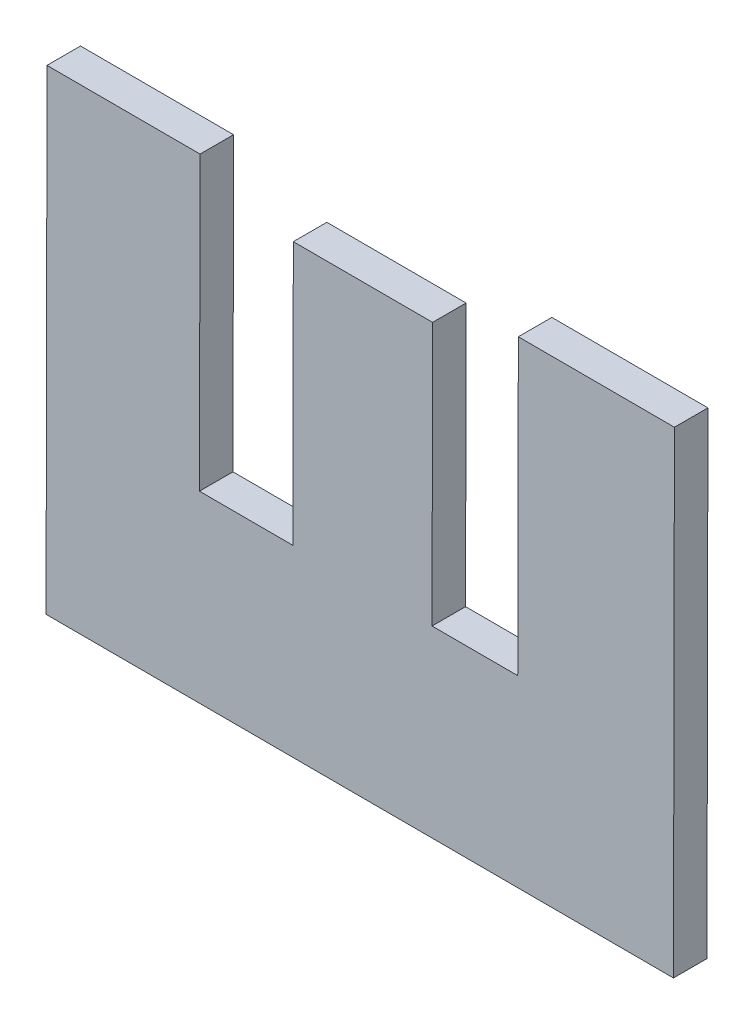
ISO-10303-21;
HEADER;
FILE_DESCRIPTION(('STEP AP214'),'2;1');
FILE_NAME('part.step','',(''),(''),'','','');
FILE_SCHEMA(('AUTOMOTIVE_DESIGN { 1 0 10303 214 1 1 1 1 }'));
ENDSEC;
DATA;
#1=APPLICATION_CONTEXT('core data for automotive mechanical design processes');
#2=APPLICATION_PROTOCOL_DEFINITION('international standard','automotive_design',2000,#1);
#3=PRODUCT_CONTEXT('',#1,'mechanical');
#4=PRODUCT('Part','Part','',(#3));
#5=PRODUCT_RELATED_PRODUCT_CATEGORY('part','',(#4));
#6=PRODUCT_DEFINITION_FORMATION('','',#4);
#7=PRODUCT_DEFINITION_CONTEXT('part definition',#1,'design');
#8=PRODUCT_DEFINITION('design','',#6,#7);
#9=PRODUCT_DEFINITION_SHAPE('','',#8);
#10=(LENGTH_UNIT() NAMED_UNIT(*) SI_UNIT(.MILLI.,.METRE.));
#11=(NAMED_UNIT(*) PLANE_ANGLE_UNIT() SI_UNIT($,.RADIAN.));
#12=(NAMED_UNIT(*) SI_UNIT($,.STERADIAN.) SOLID_ANGLE_UNIT());
#13=UNCERTAINTY_MEASURE_WITH_UNIT(LENGTH_MEASURE(1.E-05),#10,'distance_accuracy_value','');
#14=(GEOMETRIC_REPRESENTATION_CONTEXT(3) GLOBAL_UNCERTAINTY_ASSIGNED_CONTEXT((#13)) GLOBAL_UNIT_ASSIGNED_CONTEXT((#10,
#11,#12)) REPRESENTATION_CONTEXT('',''));
#15=CARTESIAN_POINT('',(0.,0.,0.));
#16=DIRECTION('',(0.,0.,1.));
#17=DIRECTION('',(1.,0.,0.));
#18=AXIS2_PLACEMENT_3D('',#15,#16,#17);
#19=CARTESIAN_POINT('',(-0.232832296777795,0.227581846757075,-0.37));
#20=DIRECTION('',(0.0019749154552477,0.999998049852571,0.));
#21=DIRECTION('',(0.999998049852571,-0.0019749154552477,0.));
#22=AXIS2_PLACEMENT_3D('',#19,#20,#21);
#23=PLANE('',#22);
#24=DIRECTION('',(0.999998049852571,-0.0019749154552477,0.));
#25=VECTOR('',#24,1.);
#26=CARTESIAN_POINT('',(-0.232832296777795,0.227581846757075,-0.37));
#27=LINE('',#26,#25);
#28=CARTESIAN_POINT('',(-0.232832296777795,0.227581846757075,-0.37));
#29=VERTEX_POINT('',#28);
#30=CARTESIAN_POINT('',(-0.219134809045468,0.227554795324101,-0.37));
#31=VERTEX_POINT('',#30);
#32=EDGE_CURVE('E11',#29,#31,#27,.T.);
#33=ORIENTED_EDGE('',*,*,#32,.T.);
#34=DIRECTION('',(0.,0.,-1.));
#35=VECTOR('',#34,1.);
#36=CARTESIAN_POINT('',(-0.219134809045468,0.227554795324101,-0.37));
#37=LINE('',#36,#35);
#38=CARTESIAN_POINT('',(-0.219134809045468,0.227554795324101,-0.373));
#39=VERTEX_POINT('',#38);
#40=EDGE_CURVE('E24',#31,#39,#37,.T.);
#41=ORIENTED_EDGE('',*,*,#40,.T.);
#42=DIRECTION('',(0.999998049852571,-0.0019749154552477,0.));
#43=VECTOR('',#42,1.);
#44=CARTESIAN_POINT('',(-0.232832296777795,0.227581846757075,-0.373));
#45=LINE('',#44,#43);
#46=CARTESIAN_POINT('',(-0.232832296777795,0.227581846757075,-0.373));
#47=VERTEX_POINT('',#46);
#48=EDGE_CURVE('E124',#47,#39,#45,.T.);
#49=ORIENTED_EDGE('',*,*,#48,.F.);
#50=DIRECTION('',(0.,0.,-1.));
#51=VECTOR('',#50,1.);
#52=CARTESIAN_POINT('',(-0.232832296777795,0.227581846757075,-0.37));
#53=LINE('',#52,#51);
#54=EDGE_CURVE('E206',#29,#47,#53,.T.);
#55=ORIENTED_EDGE('',*,*,#54,.F.);
#56=EDGE_LOOP('',(#33,#41,#49,#55));
#57=FACE_BOUND('',#56,.T.);
#58=ADVANCED_FACE('F17',(#57),#23,.T.);
#59=CARTESIAN_POINT('',(-0.23291642568743,0.184983190016065,-0.37));
#60=DIRECTION('',(-0.999998049852571,0.0019749154552669,0.));
#61=DIRECTION('',(0.0019749154552669,0.999998049852571,0.));
#62=AXIS2_PLACEMENT_3D('',#59,#60,#61);
#63=PLANE('',#62);
#64=DIRECTION('',(0.0019749154552669,0.999998049852571,0.));
#65=VECTOR('',#64,1.);
#66=CARTESIAN_POINT('',(-0.23291642568743,0.184983190016065,-0.37));
#67=LINE('',#66,#65);
#68=CARTESIAN_POINT('',(-0.23291642568743,0.184983190016065,-0.37));
#69=VERTEX_POINT('',#68);
#70=EDGE_CURVE('E203',#69,#29,#67,.T.);
#71=ORIENTED_EDGE('',*,*,#70,.T.);
#72=ORIENTED_EDGE('',*,*,#54,.T.);
#73=DIRECTION('',(0.0019749154552669,0.999998049852571,0.));
#74=VECTOR('',#73,1.);
#75=CARTESIAN_POINT('',(-0.23291642568743,0.184983190016065,-0.373));
#76=LINE('',#75,#74);
#77=CARTESIAN_POINT('',(-0.23291642568743,0.184983190016065,-0.373));
#78=VERTEX_POINT('',#77);
#79=EDGE_CURVE('E201',#78,#47,#76,.T.);
#80=ORIENTED_EDGE('',*,*,#79,.F.);
#81=DIRECTION('',(0.,0.,-1.));
#82=VECTOR('',#81,1.);
#83=CARTESIAN_POINT('',(-0.23291642568743,0.184983190016065,-0.37));
#84=LINE('',#83,#82);
#85=EDGE_CURVE('E198',#69,#78,#84,.T.);
#86=ORIENTED_EDGE('',*,*,#85,.F.);
#87=EDGE_LOOP('',(#71,#72,#80,#86));
#88=FACE_BOUND('',#87,.T.);
#89=ADVANCED_FACE('F235',(#88),#63,.T.);
#90=CARTESIAN_POINT('',(-0.176757993630782,0.184872281644366,-0.37));
#91=DIRECTION('',(-0.0019749154552616,-0.999998049852571,0.));
#92=DIRECTION('',(-0.999998049852571,0.0019749154552616,0.));
#93=AXIS2_PLACEMENT_3D('',#90,#91,#92);
#94=PLANE('',#93);
#95=DIRECTION('',(-0.999998049852571,0.0019749154552616,0.));
#96=VECTOR('',#95,1.);
#97=CARTESIAN_POINT('',(-0.176757993630782,0.184872281644366,-0.37));
#98=LINE('',#97,#96);
#99=CARTESIAN_POINT('',(-0.176757993630782,0.184872281644366,-0.37));
#100=VERTEX_POINT('',#99);
#101=EDGE_CURVE('E195',#100,#69,#98,.T.);
#102=ORIENTED_EDGE('',*,*,#101,.T.);
#103=ORIENTED_EDGE('',*,*,#85,.T.);
#104=DIRECTION('',(-0.999998049852571,0.0019749154552616,0.));
#105=VECTOR('',#104,1.);
#106=CARTESIAN_POINT('',(-0.176757993630782,0.184872281644366,-0.373));
#107=LINE('',#106,#105);
#108=CARTESIAN_POINT('',(-0.176757993630782,0.184872281644366,-0.373));
#109=VERTEX_POINT('',#108);
#110=EDGE_CURVE('E192',#109,#78,#107,.T.);
#111=ORIENTED_EDGE('',*,*,#110,.F.);
#112=DIRECTION('',(0.,0.,-1.));
#113=VECTOR('',#112,1.);
#114=CARTESIAN_POINT('',(-0.176757993630782,0.184872281644366,-0.37));
#115=LINE('',#114,#113);
#116=EDGE_CURVE('E189',#100,#109,#115,.T.);
#117=ORIENTED_EDGE('',*,*,#116,.F.);
#118=EDGE_LOOP('',(#102,#103,#111,#117));
#119=FACE_BOUND('',#118,.T.);
#120=ADVANCED_FACE('F232',(#119),#94,.T.);
#121=CARTESIAN_POINT('',(-0.176673591612283,0.227609227004608,-0.37));
#122=DIRECTION('',(0.999998049852571,-0.0019749154552604,0.));
#123=DIRECTION('',(-0.0019749154552604,-0.999998049852571,0.));
#124=AXIS2_PLACEMENT_3D('',#121,#122,#123);
#125=PLANE('',#124);
#126=DIRECTION('',(-0.0019749154552604,-0.999998049852571,0.));
#127=VECTOR('',#126,1.);
#128=CARTESIAN_POINT('',(-0.176673591612283,0.227609227004608,-0.37));
#129=LINE('',#128,#127);
#130=CARTESIAN_POINT('',(-0.176673591612283,0.227609227004608,-0.37));
#131=VERTEX_POINT('',#130);
#132=EDGE_CURVE('E186',#131,#100,#129,.T.);
#133=ORIENTED_EDGE('',*,*,#132,.T.);
#134=ORIENTED_EDGE('',*,*,#116,.T.);
#135=DIRECTION('',(-0.0019749154552604,-0.999998049852571,0.));
#136=VECTOR('',#135,1.);
#137=CARTESIAN_POINT('',(-0.176673591612283,0.227609227004608,-0.373));
#138=LINE('',#137,#136);
#139=CARTESIAN_POINT('',(-0.176673591612283,0.227609227004608,-0.373));
#140=VERTEX_POINT('',#139);
#141=EDGE_CURVE('E183',#140,#109,#138,.T.);
#142=ORIENTED_EDGE('',*,*,#141,.F.);
#143=DIRECTION('',(0.,0.,-1.));
#144=VECTOR('',#143,1.);
#145=CARTESIAN_POINT('',(-0.176673591612283,0.227609227004608,-0.37));
#146=LINE('',#145,#144);
#147=EDGE_CURVE('E180',#131,#140,#146,.T.);
#148=ORIENTED_EDGE('',*,*,#147,.F.);
#149=EDGE_LOOP('',(#133,#134,#142,#148));
#150=FACE_BOUND('',#149,.T.);
#151=ADVANCED_FACE('F229',(#150),#125,.T.);
#152=CARTESIAN_POINT('',(-0.190644775570028,0.227636818965544,-0.37));
#153=DIRECTION('',(0.0019749154552852,0.999998049852571,0.));
#154=DIRECTION('',(0.999998049852571,-0.0019749154552852,0.));
#155=AXIS2_PLACEMENT_3D('',#152,#153,#154);
#156=PLANE('',#155);
#157=DIRECTION('',(0.999998049852571,-0.0019749154552852,0.));
#158=VECTOR('',#157,1.);
#159=CARTESIAN_POINT('',(-0.190644775570028,0.227636818965544,-0.37));
#160=LINE('',#159,#158);
#161=CARTESIAN_POINT('',(-0.190644775570028,0.227636818965544,-0.37));
#162=VERTEX_POINT('',#161);
#163=EDGE_CURVE('E177',#162,#131,#160,.T.);
#164=ORIENTED_EDGE('',*,*,#163,.T.);
#165=ORIENTED_EDGE('',*,*,#147,.T.);
#166=DIRECTION('',(0.999998049852571,-0.0019749154552852,0.));
#167=VECTOR('',#166,1.);
#168=CARTESIAN_POINT('',(-0.190644775570028,0.227636818965544,-0.373));
#169=LINE('',#168,#167);
#170=CARTESIAN_POINT('',(-0.190644775570028,0.227636818965544,-0.373));
#171=VERTEX_POINT('',#170);
#172=EDGE_CURVE('E174',#171,#140,#169,.T.);
#173=ORIENTED_EDGE('',*,*,#172,.F.);
#174=DIRECTION('',(0.,0.,-1.));
#175=VECTOR('',#174,1.);
#176=CARTESIAN_POINT('',(-0.190644775570028,0.227636818965544,-0.37));
#177=LINE('',#176,#175);
#178=EDGE_CURVE('E171',#162,#171,#177,.T.);
#179=ORIENTED_EDGE('',*,*,#178,.F.);
#180=EDGE_LOOP('',(#164,#165,#173,#179));
#181=FACE_BOUND('',#180,.T.);
#182=ADVANCED_FACE('F226',(#181),#156,.T.);
#183=CARTESIAN_POINT('',(-0.190696711772324,0.201338933213314,-0.37));
#184=DIRECTION('',(-0.999998049852571,0.0019749154552656,0.));
#185=DIRECTION('',(0.0019749154552656,0.999998049852571,0.));
#186=AXIS2_PLACEMENT_3D('',#183,#184,#185);
#187=PLANE('',#186);
#188=DIRECTION('',(0.0019749154552656,0.999998049852571,0.));
#189=VECTOR('',#188,1.);
#190=CARTESIAN_POINT('',(-0.190696711772324,0.201338933213314,-0.37));
#191=LINE('',#190,#189);
#192=CARTESIAN_POINT('',(-0.190696711772324,0.201338933213314,-0.37));
#193=VERTEX_POINT('',#192);
#194=EDGE_CURVE('E168',#193,#162,#191,.T.);
#195=ORIENTED_EDGE('',*,*,#194,.T.);
#196=ORIENTED_EDGE('',*,*,#178,.T.);
#197=DIRECTION('',(0.0019749154552656,0.999998049852571,0.));
#198=VECTOR('',#197,1.);
#199=CARTESIAN_POINT('',(-0.190696711772324,0.201338933213314,-0.373));
#200=LINE('',#199,#198);
#201=CARTESIAN_POINT('',(-0.190696711772324,0.201338933213314,-0.373));
#202=VERTEX_POINT('',#201);
#203=EDGE_CURVE('E165',#202,#171,#200,.T.);
#204=ORIENTED_EDGE('',*,*,#203,.F.);
#205=DIRECTION('',(0.,0.,-1.));
#206=VECTOR('',#205,1.);
#207=CARTESIAN_POINT('',(-0.190696711772324,0.201338933213314,-0.37));
#208=LINE('',#207,#206);
#209=EDGE_CURVE('E162',#193,#202,#208,.T.);
#210=ORIENTED_EDGE('',*,*,#209,.F.);
#211=EDGE_LOOP('',(#195,#196,#204,#210));
#212=FACE_BOUND('',#211,.T.);
#213=ADVANCED_FACE('F223',(#212),#187,.T.);
#214=CARTESIAN_POINT('',(-0.198367120517592,0.201354081651635,-0.37));
#215=DIRECTION('',(0.0019749154552558,0.999998049852571,0.));
#216=DIRECTION('',(0.999998049852571,-0.0019749154552558,0.));
#217=AXIS2_PLACEMENT_3D('',#214,#215,#216);
#218=PLANE('',#217);
#219=DIRECTION('',(0.999998049852571,-0.0019749154552558,0.));
#220=VECTOR('',#219,1.);
#221=CARTESIAN_POINT('',(-0.198367120517592,0.201354081651635,-0.37));
#222=LINE('',#221,#220);
#223=CARTESIAN_POINT('',(-0.198367120517592,0.201354081651635,-0.37));
#224=VERTEX_POINT('',#223);
#225=EDGE_CURVE('E159',#224,#193,#222,.T.);
#226=ORIENTED_EDGE('',*,*,#225,.T.);
#227=ORIENTED_EDGE('',*,*,#209,.T.);
#228=DIRECTION('',(0.999998049852571,-0.0019749154552558,0.));
#229=VECTOR('',#228,1.);
#230=CARTESIAN_POINT('',(-0.198367120517592,0.201354081651635,-0.373));
#231=LINE('',#230,#229);
#232=CARTESIAN_POINT('',(-0.198367120517592,0.201354081651635,-0.373));
#233=VERTEX_POINT('',#232);
#234=EDGE_CURVE('E156',#233,#202,#231,.T.);
#235=ORIENTED_EDGE('',*,*,#234,.F.);
#236=DIRECTION('',(0.,0.,-1.));
#237=VECTOR('',#236,1.);
#238=CARTESIAN_POINT('',(-0.198367120517592,0.201354081651635,-0.37));
#239=LINE('',#238,#237);
#240=EDGE_CURVE('E153',#224,#233,#239,.T.);
#241=ORIENTED_EDGE('',*,*,#240,.F.);
#242=EDGE_LOOP('',(#226,#227,#235,#241));
#243=FACE_BOUND('',#242,.T.);
#244=ADVANCED_FACE('F220',(#243),#218,.T.);
#245=CARTESIAN_POINT('',(-0.198320589594896,0.224915005148771,-0.37));
#246=DIRECTION('',(0.999998049852571,-0.0019749154552604,0.));
#247=DIRECTION('',(-0.0019749154552604,-0.999998049852571,0.));
#248=AXIS2_PLACEMENT_3D('',#245,#246,#247);
#249=PLANE('',#248);
#250=DIRECTION('',(-0.0019749154552604,-0.999998049852571,0.));
#251=VECTOR('',#250,1.);
#252=CARTESIAN_POINT('',(-0.198320589594896,0.224915005148771,-0.37));
#253=LINE('',#252,#251);
#254=CARTESIAN_POINT('',(-0.198320589594896,0.224915005148771,-0.37));
#255=VERTEX_POINT('',#254);
#256=EDGE_CURVE('E150',#255,#224,#253,.T.);
#257=ORIENTED_EDGE('',*,*,#256,.T.);
#258=ORIENTED_EDGE('',*,*,#240,.T.);
#259=DIRECTION('',(-0.0019749154552604,-0.999998049852571,0.));
#260=VECTOR('',#259,1.);
#261=CARTESIAN_POINT('',(-0.198320589594896,0.224915005148771,-0.373));
#262=LINE('',#261,#260);
#263=CARTESIAN_POINT('',(-0.198320589594896,0.224915005148771,-0.373));
#264=VERTEX_POINT('',#263);
#265=EDGE_CURVE('E147',#264,#233,#262,.T.);
#266=ORIENTED_EDGE('',*,*,#265,.F.);
#267=DIRECTION('',(0.,0.,-1.));
#268=VECTOR('',#267,1.);
#269=CARTESIAN_POINT('',(-0.198320589594896,0.224915005148771,-0.37));
#270=LINE('',#269,#268);
#271=EDGE_CURVE('E144',#255,#264,#270,.T.);
#272=ORIENTED_EDGE('',*,*,#271,.F.);
#273=EDGE_LOOP('',(#257,#258,#266,#272));
#274=FACE_BOUND('',#273,.T.);
#275=ADVANCED_FACE('F217',(#274),#249,.T.);
#276=CARTESIAN_POINT('',(-0.210785003805928,0.224939621361043,-0.37));
#277=DIRECTION('',(0.0019749154552715,0.999998049852571,0.));
#278=DIRECTION('',(0.999998049852571,-0.0019749154552715,0.));
#279=AXIS2_PLACEMENT_3D('',#276,#277,#278);
#280=PLANE('',#279);
#281=DIRECTION('',(0.999998049852571,-0.0019749154552715,0.));
#282=VECTOR('',#281,1.);
#283=CARTESIAN_POINT('',(-0.210785003805928,0.224939621361043,-0.37));
#284=LINE('',#283,#282);
#285=CARTESIAN_POINT('',(-0.210785003805928,0.224939621361043,-0.37));
#286=VERTEX_POINT('',#285);
#287=EDGE_CURVE('E141',#286,#255,#284,.T.);
#288=ORIENTED_EDGE('',*,*,#287,.T.);
#289=ORIENTED_EDGE('',*,*,#271,.T.);
#290=DIRECTION('',(0.999998049852571,-0.0019749154552715,0.));
#291=VECTOR('',#290,1.);
#292=CARTESIAN_POINT('',(-0.210785003805928,0.224939621361043,-0.373));
#293=LINE('',#292,#291);
#294=CARTESIAN_POINT('',(-0.210785003805928,0.224939621361043,-0.373));
#295=VERTEX_POINT('',#294);
#296=EDGE_CURVE('E138',#295,#264,#293,.T.);
#297=ORIENTED_EDGE('',*,*,#296,.F.);
#298=DIRECTION('',(0.,0.,-1.));
#299=VECTOR('',#298,1.);
#300=CARTESIAN_POINT('',(-0.210785003805928,0.224939621361043,-0.37));
#301=LINE('',#300,#299);
#302=EDGE_CURVE('E135',#286,#295,#301,.T.);
#303=ORIENTED_EDGE('',*,*,#302,.F.);
#304=EDGE_LOOP('',(#288,#289,#297,#303));
#305=FACE_BOUND('',#304,.T.);
#306=ADVANCED_FACE('F214',(#305),#280,.T.);
#307=CARTESIAN_POINT('',(-0.210831534728625,0.201378697863906,-0.37));
#308=DIRECTION('',(-0.999998049852571,0.0019749154552604,0.));
#309=DIRECTION('',(0.0019749154552604,0.999998049852571,0.));
#310=AXIS2_PLACEMENT_3D('',#307,#308,#309);
#311=PLANE('',#310);
#312=DIRECTION('',(0.0019749154552604,0.999998049852571,0.));
#313=VECTOR('',#312,1.);
#314=CARTESIAN_POINT('',(-0.210831534728625,0.201378697863906,-0.37));
#315=LINE('',#314,#313);
#316=CARTESIAN_POINT('',(-0.210831534728625,0.201378697863906,-0.37));
#317=VERTEX_POINT('',#316);
#318=EDGE_CURVE('E132',#317,#286,#315,.T.);
#319=ORIENTED_EDGE('',*,*,#318,.T.);
#320=ORIENTED_EDGE('',*,*,#302,.T.);
#321=DIRECTION('',(0.0019749154552604,0.999998049852571,0.));
#322=VECTOR('',#321,1.);
#323=CARTESIAN_POINT('',(-0.210831534728625,0.201378697863906,-0.373));
#324=LINE('',#323,#322);
#325=CARTESIAN_POINT('',(-0.210831534728625,0.201378697863906,-0.373));
#326=VERTEX_POINT('',#325);
#327=EDGE_CURVE('E130',#326,#295,#324,.T.);
#328=ORIENTED_EDGE('',*,*,#327,.F.);
#329=DIRECTION('',(0.,0.,-1.));
#330=VECTOR('',#329,1.);
#331=CARTESIAN_POINT('',(-0.210831534728625,0.201378697863906,-0.37));
#332=LINE('',#331,#330);
#333=EDGE_CURVE('E109',#317,#326,#332,.T.);
#334=ORIENTED_EDGE('',*,*,#333,.F.);
#335=EDGE_LOOP('',(#319,#320,#328,#334));
#336=FACE_BOUND('',#335,.T.);
#337=ADVANCED_FACE('F212',(#336),#311,.T.);
#338=CARTESIAN_POINT('',(-0.219186472138899,0.201395198191104,-0.37));
#339=DIRECTION('',(0.001974915455277,0.999998049852571,0.));
#340=DIRECTION('',(0.999998049852571,-0.001974915455277,0.));
#341=AXIS2_PLACEMENT_3D('',#338,#339,#340);
#342=PLANE('',#341);
#343=DIRECTION('',(0.999998049852571,-0.001974915455277,0.));
#344=VECTOR('',#343,1.);
#345=CARTESIAN_POINT('',(-0.219186472138899,0.201395198191104,-0.37));
#346=LINE('',#345,#344);
#347=CARTESIAN_POINT('',(-0.219186472138899,0.201395198191104,-0.37));
#348=VERTEX_POINT('',#347);
#349=EDGE_CURVE('E113',#348,#317,#346,.T.);
#350=ORIENTED_EDGE('',*,*,#349,.T.);
#351=ORIENTED_EDGE('',*,*,#333,.T.);
#352=DIRECTION('',(0.999998049852571,-0.001974915455277,0.));
#353=VECTOR('',#352,1.);
#354=CARTESIAN_POINT('',(-0.219186472138899,0.201395198191104,-0.373));
#355=LINE('',#354,#353);
#356=CARTESIAN_POINT('',(-0.219186472138899,0.201395198191104,-0.373));
#357=VERTEX_POINT('',#356);
#358=EDGE_CURVE('E102',#357,#326,#355,.T.);
#359=ORIENTED_EDGE('',*,*,#358,.F.);
#360=DIRECTION('',(0.,0.,-1.));
#361=VECTOR('',#360,1.);
#362=CARTESIAN_POINT('',(-0.219186472138899,0.201395198191104,-0.37));
#363=LINE('',#362,#361);
#364=EDGE_CURVE('E106',#348,#357,#363,.T.);
#365=ORIENTED_EDGE('',*,*,#364,.F.);
#366=EDGE_LOOP('',(#350,#351,#359,#365));
#367=FACE_BOUND('',#366,.T.);
#368=ADVANCED_FACE('F105',(#367),#342,.T.);
#369=CARTESIAN_POINT('',(-0.219134809045468,0.227554795324101,-0.37));
#370=DIRECTION('',(0.999998049852571,-0.0019749154552604,0.));
#371=DIRECTION('',(-0.0019749154552604,-0.999998049852571,0.));
#372=AXIS2_PLACEMENT_3D('',#369,#370,#371);
#373=PLANE('',#372);
#374=DIRECTION('',(-0.0019749154552604,-0.999998049852571,0.));
#375=VECTOR('',#374,1.);
#376=CARTESIAN_POINT('',(-0.219134809045468,0.227554795324101,-0.37));
#377=LINE('',#376,#375);
#378=EDGE_CURVE('E119',#31,#348,#377,.T.);
#379=ORIENTED_EDGE('',*,*,#378,.T.);
#380=ORIENTED_EDGE('',*,*,#364,.T.);
#381=DIRECTION('',(-0.0019749154552604,-0.999998049852571,0.));
#382=VECTOR('',#381,1.);
#383=CARTESIAN_POINT('',(-0.219134809045468,0.227554795324101,-0.373));
#384=LINE('',#383,#382);
#385=EDGE_CURVE('E118',#39,#357,#384,.T.);
#386=ORIENTED_EDGE('',*,*,#385,.F.);
#387=ORIENTED_EDGE('',*,*,#40,.F.);
#388=EDGE_LOOP('',(#379,#380,#386,#387));
#389=FACE_BOUND('',#388,.T.);
#390=ADVANCED_FACE('F117',(#389),#373,.T.);
#391=CARTESIAN_POINT('',(-0.204795008649857,0.206254550304955,-0.373));
#392=DIRECTION('',(0.,0.,-1.));
#393=DIRECTION('',(-1.,0.,0.));
#394=AXIS2_PLACEMENT_3D('',#391,#392,#393);
#395=PLANE('',#394);
#396=ORIENTED_EDGE('',*,*,#385,.T.);
#397=ORIENTED_EDGE('',*,*,#358,.T.);
#398=ORIENTED_EDGE('',*,*,#327,.T.);
#399=ORIENTED_EDGE('',*,*,#296,.T.);
#400=ORIENTED_EDGE('',*,*,#265,.T.);
#401=ORIENTED_EDGE('',*,*,#234,.T.);
#402=ORIENTED_EDGE('',*,*,#203,.T.);
#403=ORIENTED_EDGE('',*,*,#172,.T.);
#404=ORIENTED_EDGE('',*,*,#141,.T.);
#405=ORIENTED_EDGE('',*,*,#110,.T.);
#406=ORIENTED_EDGE('',*,*,#79,.T.);
#407=ORIENTED_EDGE('',*,*,#48,.T.);
#408=EDGE_LOOP('',(#396,#397,#398,#399,#400,#401,#402,#403,#404,#405,#406,#407));
#409=FACE_BOUND('',#408,.T.);
#410=ADVANCED_FACE('F122',(#409),#395,.T.);
#411=CARTESIAN_POINT('',(-0.204795008649857,0.206254550304955,-0.37));
#412=DIRECTION('',(0.,0.,-1.));
#413=DIRECTION('',(-1.,0.,0.));
#414=AXIS2_PLACEMENT_3D('',#411,#412,#413);
#415=PLANE('',#414);
#416=ORIENTED_EDGE('',*,*,#378,.F.);
#417=ORIENTED_EDGE('',*,*,#32,.F.);
#418=ORIENTED_EDGE('',*,*,#70,.F.);
#419=ORIENTED_EDGE('',*,*,#101,.F.);
#420=ORIENTED_EDGE('',*,*,#132,.F.);
#421=ORIENTED_EDGE('',*,*,#163,.F.);
#422=ORIENTED_EDGE('',*,*,#194,.F.);
#423=ORIENTED_EDGE('',*,*,#225,.F.);
#424=ORIENTED_EDGE('',*,*,#256,.F.);
#425=ORIENTED_EDGE('',*,*,#287,.F.);
#426=ORIENTED_EDGE('',*,*,#318,.F.);
#427=ORIENTED_EDGE('',*,*,#349,.F.);
#428=EDGE_LOOP('',(#416,#417,#418,#419,#420,#421,#422,#423,#424,#425,#426,#427));
#429=FACE_BOUND('',#428,.T.);
#430=ADVANCED_FACE('F209',(#429),#415,.F.);
#431=CLOSED_SHELL('',(#58,#89,#120,#151,#182,#213,#244,#275,#306,#337,#368,#390,#410,#430));
#432=MANIFOLD_SOLID_BREP('B1',#431);
#433=ADVANCED_BREP_SHAPE_REPRESENTATION('',(#18,#432),#14);
#434=SHAPE_DEFINITION_REPRESENTATION(#9,#433);
ENDSEC;
END-ISO-10303-21;
